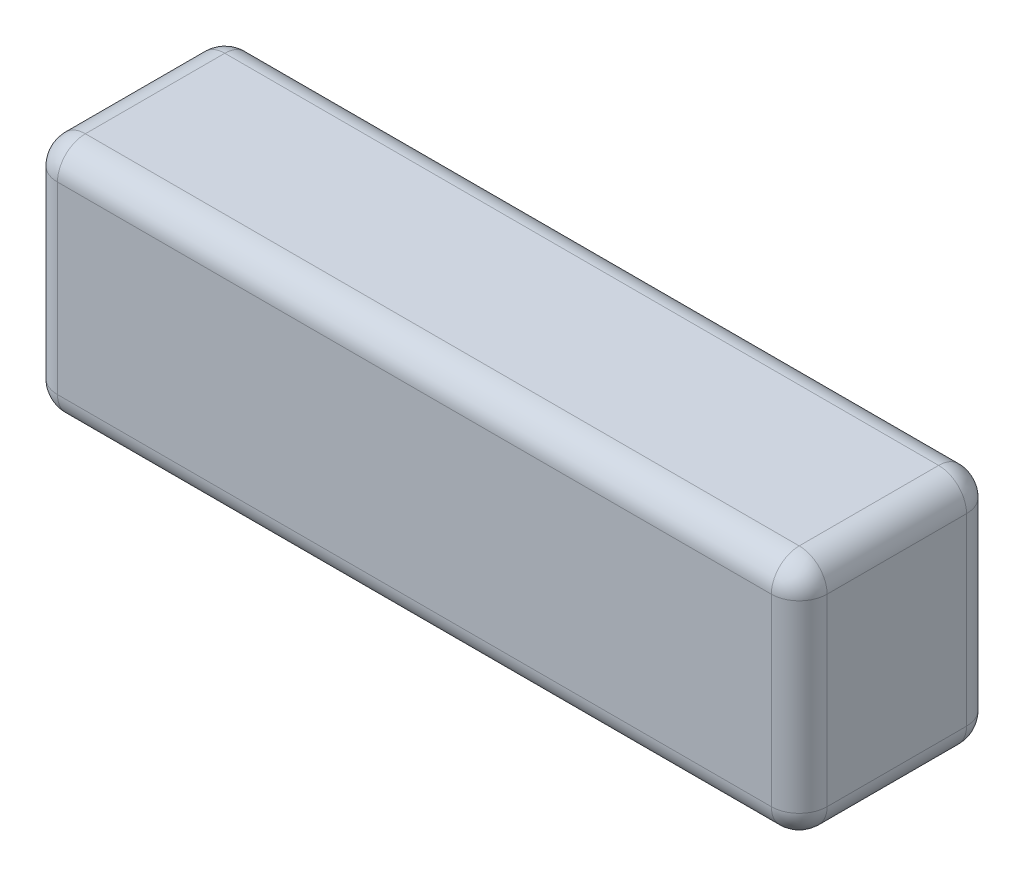
ISO-10303-21;
HEADER;
FILE_DESCRIPTION(('STEP AP214'),'2;1');
FILE_NAME('part.step','',(''),(''),'','','');
FILE_SCHEMA(('AUTOMOTIVE_DESIGN { 1 0 10303 214 1 1 1 1 }'));
ENDSEC;
DATA;
#1=APPLICATION_CONTEXT('core data for automotive mechanical design processes');
#2=APPLICATION_PROTOCOL_DEFINITION('international standard','automotive_design',2000,#1);
#3=PRODUCT_CONTEXT('',#1,'mechanical');
#4=PRODUCT('Part','Part','',(#3));
#5=PRODUCT_RELATED_PRODUCT_CATEGORY('part','',(#4));
#6=PRODUCT_DEFINITION_FORMATION('','',#4);
#7=PRODUCT_DEFINITION_CONTEXT('part definition',#1,'design');
#8=PRODUCT_DEFINITION('design','',#6,#7);
#9=PRODUCT_DEFINITION_SHAPE('','',#8);
#10=(LENGTH_UNIT() NAMED_UNIT(*) SI_UNIT(.MILLI.,.METRE.));
#11=(NAMED_UNIT(*) PLANE_ANGLE_UNIT() SI_UNIT($,.RADIAN.));
#12=(NAMED_UNIT(*) SI_UNIT($,.STERADIAN.) SOLID_ANGLE_UNIT());
#13=UNCERTAINTY_MEASURE_WITH_UNIT(LENGTH_MEASURE(1.E-05),#10,'distance_accuracy_value','');
#14=(GEOMETRIC_REPRESENTATION_CONTEXT(3) GLOBAL_UNCERTAINTY_ASSIGNED_CONTEXT((#13)) GLOBAL_UNIT_ASSIGNED_CONTEXT((#10,
#11,#12)) REPRESENTATION_CONTEXT('',''));
#15=CARTESIAN_POINT('',(0.,0.,0.));
#16=DIRECTION('',(0.,0.,1.));
#17=DIRECTION('',(1.,0.,0.));
#18=AXIS2_PLACEMENT_3D('',#15,#16,#17);
#19=CARTESIAN_POINT('',(69.,-21.5,35.));
#20=DIRECTION('',(-1.,0.,0.));
#21=DIRECTION('',(0.,0.,1.));
#22=AXIS2_PLACEMENT_3D('',#19,#20,#21);
#23=PLANE('',#22);
#24=DIRECTION('',(0.,1.,0.));
#25=VECTOR('',#24,1.);
#26=CARTESIAN_POINT('',(69.,-21.5,30.));
#27=LINE('',#26,#25);
#28=CARTESIAN_POINT('',(69.,16.5,30.));
#29=VERTEX_POINT('',#28);
#30=CARTESIAN_POINT('',(69.,-16.5,30.));
#31=VERTEX_POINT('',#30);
#32=EDGE_CURVE('E57',#29,#31,#27,.F.);
#33=ORIENTED_EDGE('',*,*,#32,.T.);
#34=DIRECTION('',(0.,0.,-1.));
#35=VECTOR('',#34,1.);
#36=CARTESIAN_POINT('',(69.,-16.5,35.));
#37=LINE('',#36,#35);
#38=CARTESIAN_POINT('',(69.,-16.5,5.));
#39=VERTEX_POINT('',#38);
#40=EDGE_CURVE('E11',#31,#39,#37,.T.);
#41=ORIENTED_EDGE('',*,*,#40,.T.);
#42=DIRECTION('',(0.,1.,0.));
#43=VECTOR('',#42,1.);
#44=CARTESIAN_POINT('',(69.,21.5,5.));
#45=LINE('',#44,#43);
#46=CARTESIAN_POINT('',(69.,16.5,5.));
#47=VERTEX_POINT('',#46);
#48=EDGE_CURVE('E43',#39,#47,#45,.T.);
#49=ORIENTED_EDGE('',*,*,#48,.T.);
#50=DIRECTION('',(0.,0.,-1.));
#51=VECTOR('',#50,1.);
#52=CARTESIAN_POINT('',(69.,16.5,35.));
#53=LINE('',#52,#51);
#54=EDGE_CURVE('E247',#47,#29,#53,.F.);
#55=ORIENTED_EDGE('',*,*,#54,.T.);
#56=EDGE_LOOP('',(#33,#41,#49,#55));
#57=FACE_BOUND('',#56,.T.);
#58=ADVANCED_FACE('F34',(#57),#23,.F.);
#59=CARTESIAN_POINT('',(-69.,21.5,35.));
#60=DIRECTION('',(0.,-1.,0.));
#61=DIRECTION('',(0.,0.,-1.));
#62=AXIS2_PLACEMENT_3D('',#59,#60,#61);
#63=PLANE('',#62);
#64=DIRECTION('',(-1.,0.,0.));
#65=VECTOR('',#64,1.);
#66=CARTESIAN_POINT('',(-69.,21.5,5.));
#67=LINE('',#66,#65);
#68=CARTESIAN_POINT('',(64.,21.5,5.));
#69=VERTEX_POINT('',#68);
#70=CARTESIAN_POINT('',(-64.,21.5,5.));
#71=VERTEX_POINT('',#70);
#72=EDGE_CURVE('E276',#69,#71,#67,.T.);
#73=ORIENTED_EDGE('',*,*,#72,.T.);
#74=DIRECTION('',(0.,0.,-1.));
#75=VECTOR('',#74,1.);
#76=CARTESIAN_POINT('',(-64.,21.5,35.));
#77=LINE('',#76,#75);
#78=CARTESIAN_POINT('',(-64.,21.5,30.));
#79=VERTEX_POINT('',#78);
#80=EDGE_CURVE('E225',#71,#79,#77,.F.);
#81=ORIENTED_EDGE('',*,*,#80,.T.);
#82=DIRECTION('',(-1.,0.,0.));
#83=VECTOR('',#82,1.);
#84=CARTESIAN_POINT('',(-69.,21.5,30.));
#85=LINE('',#84,#83);
#86=CARTESIAN_POINT('',(64.,21.5,30.));
#87=VERTEX_POINT('',#86);
#88=EDGE_CURVE('E271',#79,#87,#85,.F.);
#89=ORIENTED_EDGE('',*,*,#88,.T.);
#90=DIRECTION('',(0.,0.,-1.));
#91=VECTOR('',#90,1.);
#92=CARTESIAN_POINT('',(64.,21.5,35.));
#93=LINE('',#92,#91);
#94=EDGE_CURVE('E277',#87,#69,#93,.T.);
#95=ORIENTED_EDGE('',*,*,#94,.T.);
#96=EDGE_LOOP('',(#73,#81,#89,#95));
#97=FACE_BOUND('',#96,.T.);
#98=ADVANCED_FACE('F280',(#97),#63,.F.);
#99=CARTESIAN_POINT('',(-69.,-21.5,35.));
#100=DIRECTION('',(1.,0.,0.));
#101=DIRECTION('',(0.,0.,-1.));
#102=AXIS2_PLACEMENT_3D('',#99,#100,#101);
#103=PLANE('',#102);
#104=DIRECTION('',(0.,-1.,0.));
#105=VECTOR('',#104,1.);
#106=CARTESIAN_POINT('',(-69.,-21.5,30.));
#107=LINE('',#106,#105);
#108=CARTESIAN_POINT('',(-69.,-16.5,30.));
#109=VERTEX_POINT('',#108);
#110=CARTESIAN_POINT('',(-69.,16.5,30.));
#111=VERTEX_POINT('',#110);
#112=EDGE_CURVE('E135',#109,#111,#107,.F.);
#113=ORIENTED_EDGE('',*,*,#112,.T.);
#114=DIRECTION('',(0.,0.,-1.));
#115=VECTOR('',#114,1.);
#116=CARTESIAN_POINT('',(-69.,16.5,35.));
#117=LINE('',#116,#115);
#118=CARTESIAN_POINT('',(-69.,16.5,5.));
#119=VERTEX_POINT('',#118);
#120=EDGE_CURVE('E131',#111,#119,#117,.T.);
#121=ORIENTED_EDGE('',*,*,#120,.T.);
#122=DIRECTION('',(0.,-1.,0.));
#123=VECTOR('',#122,1.);
#124=CARTESIAN_POINT('',(-69.,-21.5,5.));
#125=LINE('',#124,#123);
#126=CARTESIAN_POINT('',(-69.,-16.5,5.));
#127=VERTEX_POINT('',#126);
#128=EDGE_CURVE('E125',#119,#127,#125,.T.);
#129=ORIENTED_EDGE('',*,*,#128,.T.);
#130=DIRECTION('',(0.,0.,-1.));
#131=VECTOR('',#130,1.);
#132=CARTESIAN_POINT('',(-69.,-16.5,35.));
#133=LINE('',#132,#131);
#134=EDGE_CURVE('E128',#127,#109,#133,.F.);
#135=ORIENTED_EDGE('',*,*,#134,.T.);
#136=EDGE_LOOP('',(#113,#121,#129,#135));
#137=FACE_BOUND('',#136,.T.);
#138=ADVANCED_FACE('F127',(#137),#103,.F.);
#139=CARTESIAN_POINT('',(-69.,-21.5,35.));
#140=DIRECTION('',(0.,1.,0.));
#141=DIRECTION('',(0.,0.,1.));
#142=AXIS2_PLACEMENT_3D('',#139,#140,#141);
#143=PLANE('',#142);
#144=DIRECTION('',(1.,0.,0.));
#145=VECTOR('',#144,1.);
#146=CARTESIAN_POINT('',(-69.,-21.5,30.));
#147=LINE('',#146,#145);
#148=CARTESIAN_POINT('',(64.,-21.5,30.));
#149=VERTEX_POINT('',#148);
#150=CARTESIAN_POINT('',(-64.,-21.5,30.));
#151=VERTEX_POINT('',#150);
#152=EDGE_CURVE('E242',#149,#151,#147,.F.);
#153=ORIENTED_EDGE('',*,*,#152,.T.);
#154=DIRECTION('',(0.,0.,-1.));
#155=VECTOR('',#154,1.);
#156=CARTESIAN_POINT('',(-64.,-21.5,35.));
#157=LINE('',#156,#155);
#158=CARTESIAN_POINT('',(-64.,-21.5,5.));
#159=VERTEX_POINT('',#158);
#160=EDGE_CURVE('E244',#151,#159,#157,.T.);
#161=ORIENTED_EDGE('',*,*,#160,.T.);
#162=DIRECTION('',(1.,0.,0.));
#163=VECTOR('',#162,1.);
#164=CARTESIAN_POINT('',(69.,-21.5,5.));
#165=LINE('',#164,#163);
#166=CARTESIAN_POINT('',(64.,-21.5,5.));
#167=VERTEX_POINT('',#166);
#168=EDGE_CURVE('E240',#159,#167,#165,.T.);
#169=ORIENTED_EDGE('',*,*,#168,.T.);
#170=DIRECTION('',(0.,0.,-1.));
#171=VECTOR('',#170,1.);
#172=CARTESIAN_POINT('',(64.,-21.5,35.));
#173=LINE('',#172,#171);
#174=EDGE_CURVE('E238',#167,#149,#173,.F.);
#175=ORIENTED_EDGE('',*,*,#174,.T.);
#176=EDGE_LOOP('',(#153,#161,#169,#175));
#177=FACE_BOUND('',#176,.T.);
#178=ADVANCED_FACE('F299',(#177),#143,.F.);
#179=CARTESIAN_POINT('',(0.,0.,35.));
#180=DIRECTION('',(0.,0.,-1.));
#181=DIRECTION('',(-1.,0.,0.));
#182=AXIS2_PLACEMENT_3D('',#179,#180,#181);
#183=PLANE('',#182);
#184=DIRECTION('',(-1.,0.,0.));
#185=VECTOR('',#184,1.);
#186=CARTESIAN_POINT('',(0.,16.5,35.));
#187=LINE('',#186,#185);
#188=CARTESIAN_POINT('',(64.,16.5,35.));
#189=VERTEX_POINT('',#188);
#190=CARTESIAN_POINT('',(-64.,16.5,35.));
#191=VERTEX_POINT('',#190);
#192=EDGE_CURVE('E221',#189,#191,#187,.T.);
#193=ORIENTED_EDGE('',*,*,#192,.T.);
#194=DIRECTION('',(0.,-1.,0.));
#195=VECTOR('',#194,1.);
#196=CARTESIAN_POINT('',(-64.,0.,35.));
#197=LINE('',#196,#195);
#198=CARTESIAN_POINT('',(-64.,-16.5,35.));
#199=VERTEX_POINT('',#198);
#200=EDGE_CURVE('E223',#191,#199,#197,.T.);
#201=ORIENTED_EDGE('',*,*,#200,.T.);
#202=DIRECTION('',(1.,0.,0.));
#203=VECTOR('',#202,1.);
#204=CARTESIAN_POINT('',(0.,-16.5,35.));
#205=LINE('',#204,#203);
#206=CARTESIAN_POINT('',(64.,-16.5,35.));
#207=VERTEX_POINT('',#206);
#208=EDGE_CURVE('E220',#199,#207,#205,.T.);
#209=ORIENTED_EDGE('',*,*,#208,.T.);
#210=DIRECTION('',(0.,1.,0.));
#211=VECTOR('',#210,1.);
#212=CARTESIAN_POINT('',(64.,0.,35.));
#213=LINE('',#212,#211);
#214=EDGE_CURVE('E217',#207,#189,#213,.T.);
#215=ORIENTED_EDGE('',*,*,#214,.T.);
#216=EDGE_LOOP('',(#193,#201,#209,#215));
#217=FACE_BOUND('',#216,.T.);
#218=ADVANCED_FACE('F293',(#217),#183,.F.);
#219=CARTESIAN_POINT('',(0.,0.,0.));
#220=DIRECTION('',(0.,0.,-1.));
#221=DIRECTION('',(-1.,0.,0.));
#222=AXIS2_PLACEMENT_3D('',#219,#220,#221);
#223=PLANE('',#222);
#224=DIRECTION('',(1.,0.,0.));
#225=VECTOR('',#224,1.);
#226=CARTESIAN_POINT('',(-69.,-16.5,0.));
#227=LINE('',#226,#225);
#228=CARTESIAN_POINT('',(64.,-16.5,0.));
#229=VERTEX_POINT('',#228);
#230=CARTESIAN_POINT('',(-64.,-16.5,0.));
#231=VERTEX_POINT('',#230);
#232=EDGE_CURVE('E235',#229,#231,#227,.F.);
#233=ORIENTED_EDGE('',*,*,#232,.T.);
#234=DIRECTION('',(0.,-1.,0.));
#235=VECTOR('',#234,1.);
#236=CARTESIAN_POINT('',(-64.,21.5,0.));
#237=LINE('',#236,#235);
#238=CARTESIAN_POINT('',(-64.,16.5,0.));
#239=VERTEX_POINT('',#238);
#240=EDGE_CURVE('E158',#231,#239,#237,.F.);
#241=ORIENTED_EDGE('',*,*,#240,.T.);
#242=DIRECTION('',(-1.,0.,0.));
#243=VECTOR('',#242,1.);
#244=CARTESIAN_POINT('',(69.,16.5,0.));
#245=LINE('',#244,#243);
#246=CARTESIAN_POINT('',(64.,16.5,0.));
#247=VERTEX_POINT('',#246);
#248=EDGE_CURVE('E233',#239,#247,#245,.F.);
#249=ORIENTED_EDGE('',*,*,#248,.T.);
#250=DIRECTION('',(0.,1.,0.));
#251=VECTOR('',#250,1.);
#252=CARTESIAN_POINT('',(64.,-21.5,0.));
#253=LINE('',#252,#251);
#254=EDGE_CURVE('E231',#247,#229,#253,.F.);
#255=ORIENTED_EDGE('',*,*,#254,.T.);
#256=EDGE_LOOP('',(#233,#241,#249,#255));
#257=FACE_BOUND('',#256,.T.);
#258=ADVANCED_FACE('F332',(#257),#223,.T.);
#259=CARTESIAN_POINT('',(64.,-16.5,35.));
#260=DIRECTION('',(0.,0.,-1.));
#261=DIRECTION('',(-1.,0.,0.));
#262=AXIS2_PLACEMENT_3D('',#259,#260,#261);
#263=CYLINDRICAL_SURFACE('',#262,5.);
#264=CARTESIAN_POINT('',(64.,-16.5,30.));
#265=DIRECTION('',(0.,0.,1.));
#266=DIRECTION('',(1.,0.,0.));
#267=AXIS2_PLACEMENT_3D('',#264,#265,#266);
#268=CIRCLE('',#267,5.);
#269=EDGE_CURVE('E38',#149,#31,#268,.T.);
#270=ORIENTED_EDGE('',*,*,#269,.F.);
#271=ORIENTED_EDGE('',*,*,#174,.F.);
#272=CARTESIAN_POINT('',(64.,-16.5,5.));
#273=DIRECTION('',(0.,0.,-1.));
#274=DIRECTION('',(-1.,0.,0.));
#275=AXIS2_PLACEMENT_3D('',#272,#273,#274);
#276=CIRCLE('',#275,5.);
#277=EDGE_CURVE('E198',#39,#167,#276,.T.);
#278=ORIENTED_EDGE('',*,*,#277,.F.);
#279=ORIENTED_EDGE('',*,*,#40,.F.);
#280=EDGE_LOOP('',(#270,#271,#278,#279));
#281=FACE_BOUND('',#280,.T.);
#282=ADVANCED_FACE('F36',(#281),#263,.T.);
#283=CARTESIAN_POINT('',(64.,-16.5,30.));
#284=DIRECTION('',(0.,0.,1.));
#285=DIRECTION('',(1.,0.,0.));
#286=AXIS2_PLACEMENT_3D('',#283,#284,#285);
#287=SPHERICAL_SURFACE('',#286,5.);
#288=CARTESIAN_POINT('',(64.,-16.5,30.));
#289=DIRECTION('',(1.,0.,0.));
#290=DIRECTION('',(0.,0.,-1.));
#291=AXIS2_PLACEMENT_3D('',#288,#289,#290);
#292=CIRCLE('',#291,5.);
#293=EDGE_CURVE('E193',#149,#207,#292,.F.);
#294=ORIENTED_EDGE('',*,*,#293,.F.);
#295=ORIENTED_EDGE('',*,*,#269,.T.);
#296=CARTESIAN_POINT('',(64.,-16.5,30.));
#297=DIRECTION('',(0.,-1.,0.));
#298=DIRECTION('',(0.,0.,-1.));
#299=AXIS2_PLACEMENT_3D('',#296,#297,#298);
#300=CIRCLE('',#299,5.);
#301=EDGE_CURVE('E196',#207,#31,#300,.F.);
#302=ORIENTED_EDGE('',*,*,#301,.F.);
#303=EDGE_LOOP('',(#294,#295,#302));
#304=FACE_BOUND('',#303,.T.);
#305=ADVANCED_FACE('F208',(#304),#287,.T.);
#306=CARTESIAN_POINT('',(64.,-16.5,5.));
#307=DIRECTION('',(0.,0.,1.));
#308=DIRECTION('',(1.,0.,0.));
#309=AXIS2_PLACEMENT_3D('',#306,#307,#308);
#310=SPHERICAL_SURFACE('',#309,5.);
#311=CARTESIAN_POINT('',(64.,-16.5,5.));
#312=DIRECTION('',(0.,-1.,0.));
#313=DIRECTION('',(0.,0.,-1.));
#314=AXIS2_PLACEMENT_3D('',#311,#312,#313);
#315=CIRCLE('',#314,5.);
#316=EDGE_CURVE('E188',#39,#229,#315,.F.);
#317=ORIENTED_EDGE('',*,*,#316,.F.);
#318=ORIENTED_EDGE('',*,*,#277,.T.);
#319=CARTESIAN_POINT('',(64.,-16.5,5.));
#320=DIRECTION('',(1.,0.,0.));
#321=DIRECTION('',(0.,0.,-1.));
#322=AXIS2_PLACEMENT_3D('',#319,#320,#321);
#323=CIRCLE('',#322,5.);
#324=EDGE_CURVE('E190',#229,#167,#323,.F.);
#325=ORIENTED_EDGE('',*,*,#324,.F.);
#326=EDGE_LOOP('',(#317,#318,#325));
#327=FACE_BOUND('',#326,.T.);
#328=ADVANCED_FACE('F356',(#327),#310,.T.);
#329=CARTESIAN_POINT('',(64.,0.,30.));
#330=DIRECTION('',(0.,1.,0.));
#331=DIRECTION('',(0.,0.,1.));
#332=AXIS2_PLACEMENT_3D('',#329,#330,#331);
#333=CYLINDRICAL_SURFACE('',#332,5.);
#334=ORIENTED_EDGE('',*,*,#301,.T.);
#335=ORIENTED_EDGE('',*,*,#32,.F.);
#336=CARTESIAN_POINT('',(64.,16.5,30.));
#337=DIRECTION('',(0.,1.,0.));
#338=DIRECTION('',(0.,0.,1.));
#339=AXIS2_PLACEMENT_3D('',#336,#337,#338);
#340=CIRCLE('',#339,5.);
#341=EDGE_CURVE('E182',#189,#29,#340,.T.);
#342=ORIENTED_EDGE('',*,*,#341,.F.);
#343=ORIENTED_EDGE('',*,*,#214,.F.);
#344=EDGE_LOOP('',(#334,#335,#342,#343));
#345=FACE_BOUND('',#344,.T.);
#346=ADVANCED_FACE('F214',(#345),#333,.T.);
#347=CARTESIAN_POINT('',(0.,-16.5,30.));
#348=DIRECTION('',(1.,0.,0.));
#349=DIRECTION('',(0.,0.,-1.));
#350=AXIS2_PLACEMENT_3D('',#347,#348,#349);
#351=CYLINDRICAL_SURFACE('',#350,5.);
#352=ORIENTED_EDGE('',*,*,#293,.T.);
#353=ORIENTED_EDGE('',*,*,#208,.F.);
#354=CARTESIAN_POINT('',(-64.,-16.5,30.));
#355=DIRECTION('',(-1.,0.,0.));
#356=DIRECTION('',(0.,0.,1.));
#357=AXIS2_PLACEMENT_3D('',#354,#355,#356);
#358=CIRCLE('',#357,5.);
#359=EDGE_CURVE('E179',#151,#199,#358,.T.);
#360=ORIENTED_EDGE('',*,*,#359,.F.);
#361=ORIENTED_EDGE('',*,*,#152,.F.);
#362=EDGE_LOOP('',(#352,#353,#360,#361));
#363=FACE_BOUND('',#362,.T.);
#364=ADVANCED_FACE('F297',(#363),#351,.T.);
#365=CARTESIAN_POINT('',(-64.,-16.5,35.));
#366=DIRECTION('',(0.,0.,-1.));
#367=DIRECTION('',(-1.,0.,0.));
#368=AXIS2_PLACEMENT_3D('',#365,#366,#367);
#369=CYLINDRICAL_SURFACE('',#368,5.);
#370=CARTESIAN_POINT('',(-64.,-16.5,5.));
#371=DIRECTION('',(0.,0.,-1.));
#372=DIRECTION('',(-1.,0.,0.));
#373=AXIS2_PLACEMENT_3D('',#370,#371,#372);
#374=CIRCLE('',#373,5.);
#375=EDGE_CURVE('E142',#159,#127,#374,.T.);
#376=ORIENTED_EDGE('',*,*,#375,.F.);
#377=ORIENTED_EDGE('',*,*,#160,.F.);
#378=CARTESIAN_POINT('',(-64.,-16.5,30.));
#379=DIRECTION('',(0.,0.,1.));
#380=DIRECTION('',(1.,0.,0.));
#381=AXIS2_PLACEMENT_3D('',#378,#379,#380);
#382=CIRCLE('',#381,5.);
#383=EDGE_CURVE('E145',#109,#151,#382,.T.);
#384=ORIENTED_EDGE('',*,*,#383,.F.);
#385=ORIENTED_EDGE('',*,*,#134,.F.);
#386=EDGE_LOOP('',(#376,#377,#384,#385));
#387=FACE_BOUND('',#386,.T.);
#388=ADVANCED_FACE('F140',(#387),#369,.T.);
#389=CARTESIAN_POINT('',(-69.,-16.5,5.));
#390=DIRECTION('',(-1.,0.,0.));
#391=DIRECTION('',(0.,0.,1.));
#392=AXIS2_PLACEMENT_3D('',#389,#390,#391);
#393=CYLINDRICAL_SURFACE('',#392,5.);
#394=ORIENTED_EDGE('',*,*,#324,.T.);
#395=ORIENTED_EDGE('',*,*,#168,.F.);
#396=CARTESIAN_POINT('',(-64.,-16.5,5.));
#397=DIRECTION('',(-1.,0.,0.));
#398=DIRECTION('',(0.,0.,1.));
#399=AXIS2_PLACEMENT_3D('',#396,#397,#398);
#400=CIRCLE('',#399,5.);
#401=EDGE_CURVE('E154',#231,#159,#400,.T.);
#402=ORIENTED_EDGE('',*,*,#401,.F.);
#403=ORIENTED_EDGE('',*,*,#232,.F.);
#404=EDGE_LOOP('',(#394,#395,#402,#403));
#405=FACE_BOUND('',#404,.T.);
#406=ADVANCED_FACE('F380',(#405),#393,.T.);
#407=CARTESIAN_POINT('',(64.,-21.5,5.));
#408=DIRECTION('',(0.,-1.,0.));
#409=DIRECTION('',(0.,0.,-1.));
#410=AXIS2_PLACEMENT_3D('',#407,#408,#409);
#411=CYLINDRICAL_SURFACE('',#410,5.);
#412=ORIENTED_EDGE('',*,*,#316,.T.);
#413=ORIENTED_EDGE('',*,*,#254,.F.);
#414=CARTESIAN_POINT('',(64.,16.5,5.));
#415=DIRECTION('',(0.,1.,0.));
#416=DIRECTION('',(0.,0.,1.));
#417=AXIS2_PLACEMENT_3D('',#414,#415,#416);
#418=CIRCLE('',#417,5.);
#419=EDGE_CURVE('E174',#47,#247,#418,.T.);
#420=ORIENTED_EDGE('',*,*,#419,.F.);
#421=ORIENTED_EDGE('',*,*,#48,.F.);
#422=EDGE_LOOP('',(#412,#413,#420,#421));
#423=FACE_BOUND('',#422,.T.);
#424=ADVANCED_FACE('F306',(#423),#411,.T.);
#425=CARTESIAN_POINT('',(64.,16.5,35.));
#426=DIRECTION('',(0.,0.,-1.));
#427=DIRECTION('',(-1.,0.,0.));
#428=AXIS2_PLACEMENT_3D('',#425,#426,#427);
#429=CYLINDRICAL_SURFACE('',#428,5.);
#430=CARTESIAN_POINT('',(64.,16.5,30.));
#431=DIRECTION('',(0.,0.,1.));
#432=DIRECTION('',(1.,0.,0.));
#433=AXIS2_PLACEMENT_3D('',#430,#431,#432);
#434=CIRCLE('',#433,5.);
#435=EDGE_CURVE('E185',#29,#87,#434,.T.);
#436=ORIENTED_EDGE('',*,*,#435,.F.);
#437=ORIENTED_EDGE('',*,*,#54,.F.);
#438=CARTESIAN_POINT('',(64.,16.5,5.));
#439=DIRECTION('',(0.,0.,-1.));
#440=DIRECTION('',(-1.,0.,0.));
#441=AXIS2_PLACEMENT_3D('',#438,#439,#440);
#442=CIRCLE('',#441,5.);
#443=EDGE_CURVE('E171',#69,#47,#442,.T.);
#444=ORIENTED_EDGE('',*,*,#443,.F.);
#445=ORIENTED_EDGE('',*,*,#94,.F.);
#446=EDGE_LOOP('',(#436,#437,#444,#445));
#447=FACE_BOUND('',#446,.T.);
#448=ADVANCED_FACE('F303',(#447),#429,.T.);
#449=CARTESIAN_POINT('',(64.,16.5,30.));
#450=DIRECTION('',(0.,0.,1.));
#451=DIRECTION('',(1.,0.,0.));
#452=AXIS2_PLACEMENT_3D('',#449,#450,#451);
#453=SPHERICAL_SURFACE('',#452,5.);
#454=ORIENTED_EDGE('',*,*,#341,.T.);
#455=ORIENTED_EDGE('',*,*,#435,.T.);
#456=CARTESIAN_POINT('',(64.,16.5,30.));
#457=DIRECTION('',(1.,0.,0.));
#458=DIRECTION('',(0.,0.,-1.));
#459=AXIS2_PLACEMENT_3D('',#456,#457,#458);
#460=CIRCLE('',#459,5.);
#461=EDGE_CURVE('E162',#189,#87,#460,.F.);
#462=ORIENTED_EDGE('',*,*,#461,.F.);
#463=EDGE_LOOP('',(#454,#455,#462));
#464=FACE_BOUND('',#463,.T.);
#465=ADVANCED_FACE('F400',(#464),#453,.T.);
#466=CARTESIAN_POINT('',(-64.,-16.5,30.));
#467=DIRECTION('',(0.,0.,1.));
#468=DIRECTION('',(1.,0.,0.));
#469=AXIS2_PLACEMENT_3D('',#466,#467,#468);
#470=SPHERICAL_SURFACE('',#469,5.);
#471=ORIENTED_EDGE('',*,*,#383,.T.);
#472=ORIENTED_EDGE('',*,*,#359,.T.);
#473=CARTESIAN_POINT('',(-64.,-16.5,30.));
#474=DIRECTION('',(0.,-1.,0.));
#475=DIRECTION('',(0.,0.,-1.));
#476=AXIS2_PLACEMENT_3D('',#473,#474,#475);
#477=CIRCLE('',#476,5.);
#478=EDGE_CURVE('E159',#109,#199,#477,.F.);
#479=ORIENTED_EDGE('',*,*,#478,.F.);
#480=EDGE_LOOP('',(#471,#472,#479));
#481=FACE_BOUND('',#480,.T.);
#482=ADVANCED_FACE('F407',(#481),#470,.T.);
#483=CARTESIAN_POINT('',(-64.,-16.5,5.));
#484=DIRECTION('',(0.,0.,1.));
#485=DIRECTION('',(1.,0.,0.));
#486=AXIS2_PLACEMENT_3D('',#483,#484,#485);
#487=SPHERICAL_SURFACE('',#486,5.);
#488=ORIENTED_EDGE('',*,*,#401,.T.);
#489=ORIENTED_EDGE('',*,*,#375,.T.);
#490=CARTESIAN_POINT('',(-64.,-16.5,5.));
#491=DIRECTION('',(0.,-1.,0.));
#492=DIRECTION('',(0.,0.,-1.));
#493=AXIS2_PLACEMENT_3D('',#490,#491,#492);
#494=CIRCLE('',#493,5.);
#495=EDGE_CURVE('E151',#231,#127,#494,.F.);
#496=ORIENTED_EDGE('',*,*,#495,.F.);
#497=EDGE_LOOP('',(#488,#489,#496));
#498=FACE_BOUND('',#497,.T.);
#499=ADVANCED_FACE('F150',(#498),#487,.T.);
#500=CARTESIAN_POINT('',(64.,16.5,5.));
#501=DIRECTION('',(0.,0.,1.));
#502=DIRECTION('',(1.,0.,0.));
#503=AXIS2_PLACEMENT_3D('',#500,#501,#502);
#504=SPHERICAL_SURFACE('',#503,5.);
#505=ORIENTED_EDGE('',*,*,#443,.T.);
#506=ORIENTED_EDGE('',*,*,#419,.T.);
#507=CARTESIAN_POINT('',(64.,16.5,5.));
#508=DIRECTION('',(1.,0.,0.));
#509=DIRECTION('',(0.,0.,-1.));
#510=AXIS2_PLACEMENT_3D('',#507,#508,#509);
#511=CIRCLE('',#510,5.);
#512=EDGE_CURVE('E160',#69,#247,#511,.F.);
#513=ORIENTED_EDGE('',*,*,#512,.F.);
#514=EDGE_LOOP('',(#505,#506,#513));
#515=FACE_BOUND('',#514,.T.);
#516=ADVANCED_FACE('F308',(#515),#504,.T.);
#517=CARTESIAN_POINT('',(0.,16.5,30.));
#518=DIRECTION('',(-1.,0.,0.));
#519=DIRECTION('',(0.,0.,1.));
#520=AXIS2_PLACEMENT_3D('',#517,#518,#519);
#521=CYLINDRICAL_SURFACE('',#520,5.);
#522=ORIENTED_EDGE('',*,*,#461,.T.);
#523=ORIENTED_EDGE('',*,*,#88,.F.);
#524=CARTESIAN_POINT('',(-64.,16.5,30.));
#525=DIRECTION('',(-1.,0.,0.));
#526=DIRECTION('',(0.,0.,1.));
#527=AXIS2_PLACEMENT_3D('',#524,#525,#526);
#528=CIRCLE('',#527,5.);
#529=EDGE_CURVE('E165',#191,#79,#528,.T.);
#530=ORIENTED_EDGE('',*,*,#529,.F.);
#531=ORIENTED_EDGE('',*,*,#192,.F.);
#532=EDGE_LOOP('',(#522,#523,#530,#531));
#533=FACE_BOUND('',#532,.T.);
#534=ADVANCED_FACE('F273',(#533),#521,.T.);
#535=CARTESIAN_POINT('',(-64.,0.,30.));
#536=DIRECTION('',(0.,-1.,0.));
#537=DIRECTION('',(0.,0.,-1.));
#538=AXIS2_PLACEMENT_3D('',#535,#536,#537);
#539=CYLINDRICAL_SURFACE('',#538,5.);
#540=ORIENTED_EDGE('',*,*,#478,.T.);
#541=ORIENTED_EDGE('',*,*,#200,.F.);
#542=CARTESIAN_POINT('',(-64.,16.5,30.));
#543=DIRECTION('',(0.,1.,0.));
#544=DIRECTION('',(0.,0.,1.));
#545=AXIS2_PLACEMENT_3D('',#542,#543,#544);
#546=CIRCLE('',#545,5.);
#547=EDGE_CURVE('E260',#111,#191,#546,.T.);
#548=ORIENTED_EDGE('',*,*,#547,.F.);
#549=ORIENTED_EDGE('',*,*,#112,.F.);
#550=EDGE_LOOP('',(#540,#541,#548,#549));
#551=FACE_BOUND('',#550,.T.);
#552=ADVANCED_FACE('F292',(#551),#539,.T.);
#553=CARTESIAN_POINT('',(-64.,-21.5,5.));
#554=DIRECTION('',(0.,1.,0.));
#555=DIRECTION('',(0.,0.,1.));
#556=AXIS2_PLACEMENT_3D('',#553,#554,#555);
#557=CYLINDRICAL_SURFACE('',#556,5.);
#558=ORIENTED_EDGE('',*,*,#495,.T.);
#559=ORIENTED_EDGE('',*,*,#128,.F.);
#560=CARTESIAN_POINT('',(-64.,16.5,5.));
#561=DIRECTION('',(0.,1.,0.));
#562=DIRECTION('',(-1.,0.,0.));
#563=AXIS2_PLACEMENT_3D('',#560,#561,#562);
#564=CIRCLE('',#563,5.);
#565=EDGE_CURVE('E257',#239,#119,#564,.T.);
#566=ORIENTED_EDGE('',*,*,#565,.F.);
#567=ORIENTED_EDGE('',*,*,#240,.F.);
#568=EDGE_LOOP('',(#558,#559,#566,#567));
#569=FACE_BOUND('',#568,.T.);
#570=ADVANCED_FACE('F156',(#569),#557,.T.);
#571=CARTESIAN_POINT('',(-69.,16.5,5.));
#572=DIRECTION('',(1.,0.,0.));
#573=DIRECTION('',(0.,0.,-1.));
#574=AXIS2_PLACEMENT_3D('',#571,#572,#573);
#575=CYLINDRICAL_SURFACE('',#574,5.);
#576=ORIENTED_EDGE('',*,*,#512,.T.);
#577=ORIENTED_EDGE('',*,*,#248,.F.);
#578=CARTESIAN_POINT('',(-64.,16.5,5.));
#579=DIRECTION('',(-1.,0.,0.));
#580=DIRECTION('',(0.,0.,1.));
#581=AXIS2_PLACEMENT_3D('',#578,#579,#580);
#582=CIRCLE('',#581,5.);
#583=EDGE_CURVE('E255',#71,#239,#582,.T.);
#584=ORIENTED_EDGE('',*,*,#583,.F.);
#585=ORIENTED_EDGE('',*,*,#72,.F.);
#586=EDGE_LOOP('',(#576,#577,#584,#585));
#587=FACE_BOUND('',#586,.T.);
#588=ADVANCED_FACE('F311',(#587),#575,.T.);
#589=CARTESIAN_POINT('',(-64.,16.5,30.));
#590=DIRECTION('',(0.,0.,1.));
#591=DIRECTION('',(1.,0.,0.));
#592=AXIS2_PLACEMENT_3D('',#589,#590,#591);
#593=SPHERICAL_SURFACE('',#592,5.);
#594=ORIENTED_EDGE('',*,*,#547,.T.);
#595=ORIENTED_EDGE('',*,*,#529,.T.);
#596=CARTESIAN_POINT('',(-64.,16.5,30.));
#597=DIRECTION('',(0.,0.,1.));
#598=DIRECTION('',(1.,0.,0.));
#599=AXIS2_PLACEMENT_3D('',#596,#597,#598);
#600=CIRCLE('',#599,5.);
#601=EDGE_CURVE('E253',#111,#79,#600,.F.);
#602=ORIENTED_EDGE('',*,*,#601,.F.);
#603=EDGE_LOOP('',(#594,#595,#602));
#604=FACE_BOUND('',#603,.T.);
#605=ADVANCED_FACE('F267',(#604),#593,.T.);
#606=CARTESIAN_POINT('',(-64.,16.5,5.));
#607=DIRECTION('',(0.,0.,1.));
#608=DIRECTION('',(1.,0.,0.));
#609=AXIS2_PLACEMENT_3D('',#606,#607,#608);
#610=SPHERICAL_SURFACE('',#609,5.);
#611=ORIENTED_EDGE('',*,*,#583,.T.);
#612=ORIENTED_EDGE('',*,*,#565,.T.);
#613=CARTESIAN_POINT('',(-64.,16.5,5.));
#614=DIRECTION('',(0.,0.,-1.));
#615=DIRECTION('',(-1.,0.,0.));
#616=AXIS2_PLACEMENT_3D('',#613,#614,#615);
#617=CIRCLE('',#616,5.);
#618=EDGE_CURVE('E251',#71,#119,#617,.F.);
#619=ORIENTED_EDGE('',*,*,#618,.F.);
#620=EDGE_LOOP('',(#611,#612,#619));
#621=FACE_BOUND('',#620,.T.);
#622=ADVANCED_FACE('F313',(#621),#610,.T.);
#623=CARTESIAN_POINT('',(-64.,16.5,35.));
#624=DIRECTION('',(0.,0.,-1.));
#625=DIRECTION('',(-1.,0.,0.));
#626=AXIS2_PLACEMENT_3D('',#623,#624,#625);
#627=CYLINDRICAL_SURFACE('',#626,5.);
#628=ORIENTED_EDGE('',*,*,#601,.T.);
#629=ORIENTED_EDGE('',*,*,#80,.F.);
#630=ORIENTED_EDGE('',*,*,#618,.T.);
#631=ORIENTED_EDGE('',*,*,#120,.F.);
#632=EDGE_LOOP('',(#628,#629,#630,#631));
#633=FACE_BOUND('',#632,.T.);
#634=ADVANCED_FACE('F314',(#633),#627,.T.);
#635=CLOSED_SHELL('',(#58,#98,#138,#178,#218,#258,#282,#305,#328,#346,#364,#388,#406,#424,#448,
#465,#482,#499,#516,#534,#552,#570,#588,#605,#622,#634));
#636=MANIFOLD_SOLID_BREP('B2',#635);
#637=ADVANCED_BREP_SHAPE_REPRESENTATION('',(#18,#636),#14);
#638=SHAPE_DEFINITION_REPRESENTATION(#9,#637);
ENDSEC;
END-ISO-10303-21;
